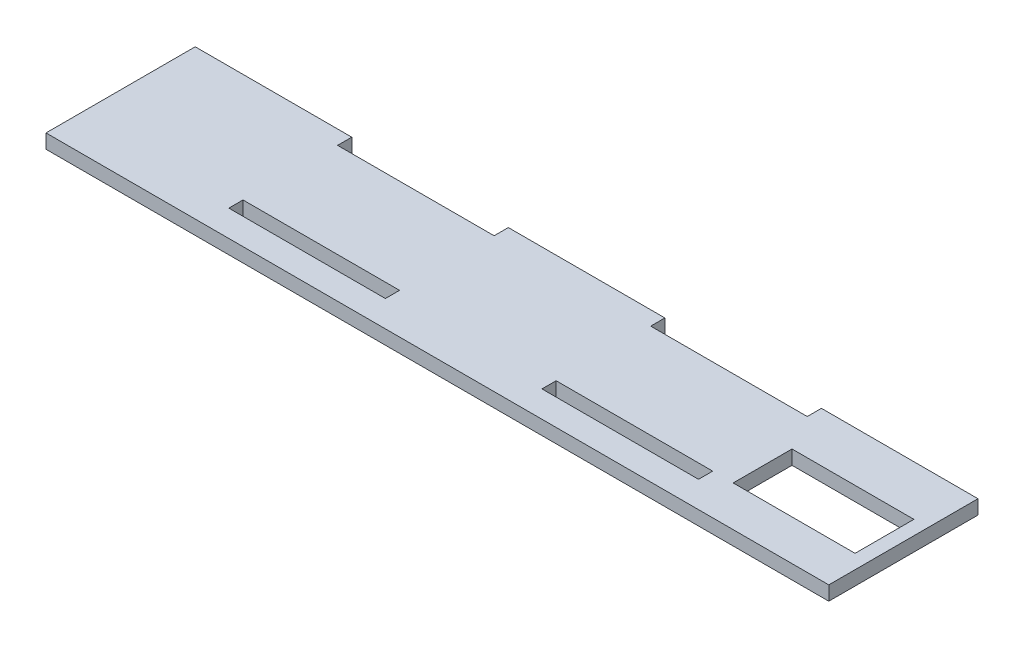
ISO-10303-21;
HEADER;
FILE_DESCRIPTION(('STEP AP214'),'2;1');
FILE_NAME('part.step','',(''),(''),'','','');
FILE_SCHEMA(('AUTOMOTIVE_DESIGN { 1 0 10303 214 1 1 1 1 }'));
ENDSEC;
DATA;
#1=APPLICATION_CONTEXT('core data for automotive mechanical design processes');
#2=APPLICATION_PROTOCOL_DEFINITION('international standard','automotive_design',2000,#1);
#3=PRODUCT_CONTEXT('',#1,'mechanical');
#4=PRODUCT('Part','Part','',(#3));
#5=PRODUCT_RELATED_PRODUCT_CATEGORY('part','',(#4));
#6=PRODUCT_DEFINITION_FORMATION('','',#4);
#7=PRODUCT_DEFINITION_CONTEXT('part definition',#1,'design');
#8=PRODUCT_DEFINITION('design','',#6,#7);
#9=PRODUCT_DEFINITION_SHAPE('','',#8);
#10=(LENGTH_UNIT() NAMED_UNIT(*) SI_UNIT(.MILLI.,.METRE.));
#11=(NAMED_UNIT(*) PLANE_ANGLE_UNIT() SI_UNIT($,.RADIAN.));
#12=(NAMED_UNIT(*) SI_UNIT($,.STERADIAN.) SOLID_ANGLE_UNIT());
#13=UNCERTAINTY_MEASURE_WITH_UNIT(LENGTH_MEASURE(1.E-05),#10,'distance_accuracy_value','');
#14=(GEOMETRIC_REPRESENTATION_CONTEXT(3) GLOBAL_UNCERTAINTY_ASSIGNED_CONTEXT((#13)) GLOBAL_UNIT_ASSIGNED_CONTEXT((#10,
#11,#12)) REPRESENTATION_CONTEXT('',''));
#15=CARTESIAN_POINT('',(0.,0.,0.));
#16=DIRECTION('',(0.,0.,1.));
#17=DIRECTION('',(1.,0.,0.));
#18=AXIS2_PLACEMENT_3D('',#15,#16,#17);
#19=CARTESIAN_POINT('',(0.,2.7,0.));
#20=DIRECTION('',(0.,1.,0.));
#21=DIRECTION('',(0.,0.,1.));
#22=AXIS2_PLACEMENT_3D('',#19,#20,#21);
#23=PLANE('',#22);
#24=DIRECTION('',(-1.,0.,0.));
#25=VECTOR('',#24,1.);
#26=CARTESIAN_POINT('',(44.6999999999999,2.7,-14.2));
#27=LINE('',#26,#25);
#28=CARTESIAN_POINT('',(74.4999999999999,2.7,-14.2));
#29=VERTEX_POINT('',#28);
#30=CARTESIAN_POINT('',(44.6999999999999,2.7,-14.2));
#31=VERTEX_POINT('',#30);
#32=EDGE_CURVE('E292',#29,#31,#27,.T.);
#33=ORIENTED_EDGE('',*,*,#32,.T.);
#34=DIRECTION('',(0.,0.,1.));
#35=VECTOR('',#34,1.);
#36=CARTESIAN_POINT('',(44.6999999999999,2.7,-14.2));
#37=LINE('',#36,#35);
#38=CARTESIAN_POINT('',(44.6999999999999,2.7,-11.5));
#39=VERTEX_POINT('',#38);
#40=EDGE_CURVE('E295',#31,#39,#37,.T.);
#41=ORIENTED_EDGE('',*,*,#40,.T.);
#42=DIRECTION('',(-1.,0.,0.));
#43=VECTOR('',#42,1.);
#44=CARTESIAN_POINT('',(14.8999999999999,2.7,-11.5));
#45=LINE('',#44,#43);
#46=CARTESIAN_POINT('',(14.8999999999999,2.7,-11.5));
#47=VERTEX_POINT('',#46);
#48=EDGE_CURVE('E298',#39,#47,#45,.T.);
#49=ORIENTED_EDGE('',*,*,#48,.T.);
#50=DIRECTION('',(0.,0.,-1.));
#51=VECTOR('',#50,1.);
#52=CARTESIAN_POINT('',(14.8999999999999,2.7,-14.2));
#53=LINE('',#52,#51);
#54=CARTESIAN_POINT('',(14.8999999999999,2.7,-14.2));
#55=VERTEX_POINT('',#54);
#56=EDGE_CURVE('E300',#47,#55,#53,.T.);
#57=ORIENTED_EDGE('',*,*,#56,.T.);
#58=DIRECTION('',(-1.,0.,0.));
#59=VECTOR('',#58,1.);
#60=CARTESIAN_POINT('',(-14.9000000000001,2.7,-14.2));
#61=LINE('',#60,#59);
#62=CARTESIAN_POINT('',(-14.9000000000001,2.7,-14.2));
#63=VERTEX_POINT('',#62);
#64=EDGE_CURVE('E302',#55,#63,#61,.T.);
#65=ORIENTED_EDGE('',*,*,#64,.T.);
#66=DIRECTION('',(0.,0.,1.));
#67=VECTOR('',#66,1.);
#68=CARTESIAN_POINT('',(-14.9000000000001,2.7,-14.2));
#69=LINE('',#68,#67);
#70=CARTESIAN_POINT('',(-14.9000000000001,2.7,-11.5));
#71=VERTEX_POINT('',#70);
#72=EDGE_CURVE('E304',#63,#71,#69,.T.);
#73=ORIENTED_EDGE('',*,*,#72,.T.);
#74=DIRECTION('',(-1.,0.,0.));
#75=VECTOR('',#74,1.);
#76=CARTESIAN_POINT('',(-44.7000000000001,2.7,-11.5));
#77=LINE('',#76,#75);
#78=CARTESIAN_POINT('',(-44.7000000000001,2.7,-11.5));
#79=VERTEX_POINT('',#78);
#80=EDGE_CURVE('E306',#71,#79,#77,.T.);
#81=ORIENTED_EDGE('',*,*,#80,.T.);
#82=DIRECTION('',(0.,0.,-1.));
#83=VECTOR('',#82,1.);
#84=CARTESIAN_POINT('',(-44.7000000000001,2.7,-14.2));
#85=LINE('',#84,#83);
#86=CARTESIAN_POINT('',(-44.7000000000001,2.7,-14.2));
#87=VERTEX_POINT('',#86);
#88=EDGE_CURVE('E308',#79,#87,#85,.T.);
#89=ORIENTED_EDGE('',*,*,#88,.T.);
#90=DIRECTION('',(-1.,0.,0.));
#91=VECTOR('',#90,1.);
#92=CARTESIAN_POINT('',(-74.5000000000001,2.7,-14.2));
#93=LINE('',#92,#91);
#94=CARTESIAN_POINT('',(-74.5000000000001,2.7,-14.2));
#95=VERTEX_POINT('',#94);
#96=EDGE_CURVE('E310',#87,#95,#93,.T.);
#97=ORIENTED_EDGE('',*,*,#96,.T.);
#98=DIRECTION('',(0.,0.,1.));
#99=VECTOR('',#98,1.);
#100=CARTESIAN_POINT('',(-74.5000000000001,2.7,14.2));
#101=LINE('',#100,#99);
#102=CARTESIAN_POINT('',(-74.5000000000001,2.7,14.2));
#103=VERTEX_POINT('',#102);
#104=EDGE_CURVE('E312',#95,#103,#101,.T.);
#105=ORIENTED_EDGE('',*,*,#104,.T.);
#106=DIRECTION('',(1.,0.,0.));
#107=VECTOR('',#106,1.);
#108=CARTESIAN_POINT('',(-74.5000000000001,2.7,14.2));
#109=LINE('',#108,#107);
#110=CARTESIAN_POINT('',(74.4999999999999,2.7,14.2));
#111=VERTEX_POINT('',#110);
#112=EDGE_CURVE('E314',#103,#111,#109,.T.);
#113=ORIENTED_EDGE('',*,*,#112,.T.);
#114=DIRECTION('',(0.,0.,-1.));
#115=VECTOR('',#114,1.);
#116=CARTESIAN_POINT('',(74.4999999999999,2.7,14.2));
#117=LINE('',#116,#115);
#118=EDGE_CURVE('E316',#111,#29,#117,.T.);
#119=ORIENTED_EDGE('',*,*,#118,.T.);
#120=EDGE_LOOP('',(#33,#41,#49,#57,#65,#73,#81,#89,#97,#105,#113,#119));
#121=FACE_BOUND('',#120,.T.);
#122=DIRECTION('',(0.,0.,-1.));
#123=VECTOR('',#122,1.);
#124=CARTESIAN_POINT('',(71.7999999999999,2.7,6.50000000000001));
#125=LINE('',#124,#123);
#126=CARTESIAN_POINT('',(71.7999999999999,2.7,6.50000000000001));
#127=VERTEX_POINT('',#126);
#128=CARTESIAN_POINT('',(71.7999999999999,2.7,-4.69999999999999));
#129=VERTEX_POINT('',#128);
#130=EDGE_CURVE('E263',#127,#129,#125,.T.);
#131=ORIENTED_EDGE('',*,*,#130,.F.);
#132=DIRECTION('',(1.,0.,0.));
#133=VECTOR('',#132,1.);
#134=CARTESIAN_POINT('',(48.5999999999999,2.7,6.50000000000001));
#135=LINE('',#134,#133);
#136=CARTESIAN_POINT('',(48.5999999999999,2.7,6.50000000000001));
#137=VERTEX_POINT('',#136);
#138=EDGE_CURVE('E261',#137,#127,#135,.T.);
#139=ORIENTED_EDGE('',*,*,#138,.F.);
#140=DIRECTION('',(0.,0.,1.));
#141=VECTOR('',#140,1.);
#142=CARTESIAN_POINT('',(48.5999999999999,2.7,-4.69999999999999));
#143=LINE('',#142,#141);
#144=CARTESIAN_POINT('',(48.5999999999999,2.7,-4.69999999999999));
#145=VERTEX_POINT('',#144);
#146=EDGE_CURVE('E269',#145,#137,#143,.T.);
#147=ORIENTED_EDGE('',*,*,#146,.F.);
#148=DIRECTION('',(-1.,0.,0.));
#149=VECTOR('',#148,1.);
#150=CARTESIAN_POINT('',(71.7999999999999,2.7,-4.69999999999999));
#151=LINE('',#150,#149);
#152=EDGE_CURVE('E266',#129,#145,#151,.T.);
#153=ORIENTED_EDGE('',*,*,#152,.F.);
#154=EDGE_LOOP('',(#131,#139,#147,#153));
#155=FACE_BOUND('',#154,.T.);
#156=DIRECTION('',(-1.,0.,0.));
#157=VECTOR('',#156,1.);
#158=CARTESIAN_POINT('',(14.8999999999999,2.7,6.50000000000001));
#159=LINE('',#158,#157);
#160=CARTESIAN_POINT('',(44.6999999999999,2.7,6.50000000000001));
#161=VERTEX_POINT('',#160);
#162=CARTESIAN_POINT('',(14.8999999999999,2.7,6.50000000000001));
#163=VERTEX_POINT('',#162);
#164=EDGE_CURVE('E232',#161,#163,#159,.T.);
#165=ORIENTED_EDGE('',*,*,#164,.F.);
#166=DIRECTION('',(0.,0.,-1.));
#167=VECTOR('',#166,1.);
#168=CARTESIAN_POINT('',(44.6999999999999,2.7,6.50000000000001));
#169=LINE('',#168,#167);
#170=CARTESIAN_POINT('',(44.6999999999999,2.7,9.20000000000001));
#171=VERTEX_POINT('',#170);
#172=EDGE_CURVE('E230',#171,#161,#169,.T.);
#173=ORIENTED_EDGE('',*,*,#172,.F.);
#174=DIRECTION('',(1.,0.,0.));
#175=VECTOR('',#174,1.);
#176=CARTESIAN_POINT('',(14.8999999999999,2.7,9.20000000000001));
#177=LINE('',#176,#175);
#178=CARTESIAN_POINT('',(14.8999999999999,2.7,9.20000000000001));
#179=VERTEX_POINT('',#178);
#180=EDGE_CURVE('E238',#179,#171,#177,.T.);
#181=ORIENTED_EDGE('',*,*,#180,.F.);
#182=DIRECTION('',(0.,0.,1.));
#183=VECTOR('',#182,1.);
#184=CARTESIAN_POINT('',(14.8999999999999,2.7,6.50000000000001));
#185=LINE('',#184,#183);
#186=EDGE_CURVE('E235',#163,#179,#185,.T.);
#187=ORIENTED_EDGE('',*,*,#186,.F.);
#188=EDGE_LOOP('',(#165,#173,#181,#187));
#189=FACE_BOUND('',#188,.T.);
#190=DIRECTION('',(1.,0.,0.));
#191=VECTOR('',#190,1.);
#192=CARTESIAN_POINT('',(-44.7000000000001,2.7,9.20000000000001));
#193=LINE('',#192,#191);
#194=CARTESIAN_POINT('',(-44.7000000000001,2.7,9.20000000000001));
#195=VERTEX_POINT('',#194);
#196=CARTESIAN_POINT('',(-14.9000000000001,2.7,9.20000000000001));
#197=VERTEX_POINT('',#196);
#198=EDGE_CURVE('E202',#195,#197,#193,.T.);
#199=ORIENTED_EDGE('',*,*,#198,.F.);
#200=DIRECTION('',(0.,0.,1.));
#201=VECTOR('',#200,1.);
#202=CARTESIAN_POINT('',(-44.7000000000001,2.7,6.50000000000001));
#203=LINE('',#202,#201);
#204=CARTESIAN_POINT('',(-44.7000000000001,2.7,6.50000000000001));
#205=VERTEX_POINT('',#204);
#206=EDGE_CURVE('E194',#205,#195,#203,.T.);
#207=ORIENTED_EDGE('',*,*,#206,.F.);
#208=DIRECTION('',(-1.,0.,0.));
#209=VECTOR('',#208,1.);
#210=CARTESIAN_POINT('',(-44.7000000000001,2.7,6.50000000000001));
#211=LINE('',#210,#209);
#212=CARTESIAN_POINT('',(-14.9000000000001,2.7,6.50000000000001));
#213=VERTEX_POINT('',#212);
#214=EDGE_CURVE('E216',#213,#205,#211,.T.);
#215=ORIENTED_EDGE('',*,*,#214,.F.);
#216=DIRECTION('',(0.,0.,-1.));
#217=VECTOR('',#216,1.);
#218=CARTESIAN_POINT('',(-14.9000000000001,2.7,6.50000000000001));
#219=LINE('',#218,#217);
#220=EDGE_CURVE('E214',#197,#213,#219,.T.);
#221=ORIENTED_EDGE('',*,*,#220,.F.);
#222=EDGE_LOOP('',(#199,#207,#215,#221));
#223=FACE_BOUND('',#222,.T.);
#224=ADVANCED_FACE('F33',(#121,#155,#189,#223),#23,.T.);
#225=CARTESIAN_POINT('',(0.,0.,0.));
#226=DIRECTION('',(0.,1.,0.));
#227=DIRECTION('',(0.,0.,1.));
#228=AXIS2_PLACEMENT_3D('',#225,#226,#227);
#229=PLANE('',#228);
#230=DIRECTION('',(0.,0.,-1.));
#231=VECTOR('',#230,1.);
#232=CARTESIAN_POINT('',(44.6999999999999,0.,6.50000000000001));
#233=LINE('',#232,#231);
#234=CARTESIAN_POINT('',(44.6999999999999,0.,9.20000000000001));
#235=VERTEX_POINT('',#234);
#236=CARTESIAN_POINT('',(44.6999999999999,0.,6.50000000000001));
#237=VERTEX_POINT('',#236);
#238=EDGE_CURVE('E210',#235,#237,#233,.T.);
#239=ORIENTED_EDGE('',*,*,#238,.T.);
#240=DIRECTION('',(-1.,0.,0.));
#241=VECTOR('',#240,1.);
#242=CARTESIAN_POINT('',(14.8999999999999,0.,6.50000000000001));
#243=LINE('',#242,#241);
#244=CARTESIAN_POINT('',(14.8999999999999,0.,6.50000000000001));
#245=VERTEX_POINT('',#244);
#246=EDGE_CURVE('E243',#237,#245,#243,.T.);
#247=ORIENTED_EDGE('',*,*,#246,.T.);
#248=DIRECTION('',(0.,0.,1.));
#249=VECTOR('',#248,1.);
#250=CARTESIAN_POINT('',(14.8999999999999,0.,6.50000000000001));
#251=LINE('',#250,#249);
#252=CARTESIAN_POINT('',(14.8999999999999,0.,9.20000000000001));
#253=VERTEX_POINT('',#252);
#254=EDGE_CURVE('E246',#245,#253,#251,.T.);
#255=ORIENTED_EDGE('',*,*,#254,.T.);
#256=DIRECTION('',(1.,0.,0.));
#257=VECTOR('',#256,1.);
#258=CARTESIAN_POINT('',(14.8999999999999,0.,9.20000000000001));
#259=LINE('',#258,#257);
#260=EDGE_CURVE('E233',#253,#235,#259,.T.);
#261=ORIENTED_EDGE('',*,*,#260,.T.);
#262=EDGE_LOOP('',(#239,#247,#255,#261));
#263=FACE_BOUND('',#262,.T.);
#264=DIRECTION('',(-1.,0.,0.));
#265=VECTOR('',#264,1.);
#266=CARTESIAN_POINT('',(44.6999999999999,0.,-14.2));
#267=LINE('',#266,#265);
#268=CARTESIAN_POINT('',(74.4999999999999,0.,-14.2));
#269=VERTEX_POINT('',#268);
#270=CARTESIAN_POINT('',(44.6999999999999,0.,-14.2));
#271=VERTEX_POINT('',#270);
#272=EDGE_CURVE('E291',#269,#271,#267,.T.);
#273=ORIENTED_EDGE('',*,*,#272,.F.);
#274=DIRECTION('',(0.,0.,-1.));
#275=VECTOR('',#274,1.);
#276=CARTESIAN_POINT('',(74.4999999999999,0.,14.2));
#277=LINE('',#276,#275);
#278=CARTESIAN_POINT('',(74.4999999999999,0.,14.2));
#279=VERTEX_POINT('',#278);
#280=EDGE_CURVE('E296',#279,#269,#277,.T.);
#281=ORIENTED_EDGE('',*,*,#280,.F.);
#282=DIRECTION('',(1.,0.,0.));
#283=VECTOR('',#282,1.);
#284=CARTESIAN_POINT('',(-74.5000000000001,0.,14.2));
#285=LINE('',#284,#283);
#286=CARTESIAN_POINT('',(-74.5000000000001,0.,14.2));
#287=VERTEX_POINT('',#286);
#288=EDGE_CURVE('E339',#287,#279,#285,.T.);
#289=ORIENTED_EDGE('',*,*,#288,.F.);
#290=DIRECTION('',(0.,0.,1.));
#291=VECTOR('',#290,1.);
#292=CARTESIAN_POINT('',(-74.5000000000001,0.,14.2));
#293=LINE('',#292,#291);
#294=CARTESIAN_POINT('',(-74.5000000000001,0.,-14.2));
#295=VERTEX_POINT('',#294);
#296=EDGE_CURVE('E337',#295,#287,#293,.T.);
#297=ORIENTED_EDGE('',*,*,#296,.F.);
#298=DIRECTION('',(-1.,0.,0.));
#299=VECTOR('',#298,1.);
#300=CARTESIAN_POINT('',(-74.5000000000001,0.,-14.2));
#301=LINE('',#300,#299);
#302=CARTESIAN_POINT('',(-44.7000000000001,0.,-14.2));
#303=VERTEX_POINT('',#302);
#304=EDGE_CURVE('E335',#303,#295,#301,.T.);
#305=ORIENTED_EDGE('',*,*,#304,.F.);
#306=DIRECTION('',(0.,0.,-1.));
#307=VECTOR('',#306,1.);
#308=CARTESIAN_POINT('',(-44.7000000000001,0.,-14.2));
#309=LINE('',#308,#307);
#310=CARTESIAN_POINT('',(-44.7000000000001,0.,-11.5));
#311=VERTEX_POINT('',#310);
#312=EDGE_CURVE('E333',#311,#303,#309,.T.);
#313=ORIENTED_EDGE('',*,*,#312,.F.);
#314=DIRECTION('',(-1.,0.,0.));
#315=VECTOR('',#314,1.);
#316=CARTESIAN_POINT('',(-44.7000000000001,0.,-11.5));
#317=LINE('',#316,#315);
#318=CARTESIAN_POINT('',(-14.9000000000001,0.,-11.5));
#319=VERTEX_POINT('',#318);
#320=EDGE_CURVE('E331',#319,#311,#317,.T.);
#321=ORIENTED_EDGE('',*,*,#320,.F.);
#322=DIRECTION('',(0.,0.,1.));
#323=VECTOR('',#322,1.);
#324=CARTESIAN_POINT('',(-14.9000000000001,0.,-14.2));
#325=LINE('',#324,#323);
#326=CARTESIAN_POINT('',(-14.9000000000001,0.,-14.2));
#327=VERTEX_POINT('',#326);
#328=EDGE_CURVE('E329',#327,#319,#325,.T.);
#329=ORIENTED_EDGE('',*,*,#328,.F.);
#330=DIRECTION('',(-1.,0.,0.));
#331=VECTOR('',#330,1.);
#332=CARTESIAN_POINT('',(-14.9000000000001,0.,-14.2));
#333=LINE('',#332,#331);
#334=CARTESIAN_POINT('',(14.8999999999999,0.,-14.2));
#335=VERTEX_POINT('',#334);
#336=EDGE_CURVE('E327',#335,#327,#333,.T.);
#337=ORIENTED_EDGE('',*,*,#336,.F.);
#338=DIRECTION('',(0.,0.,-1.));
#339=VECTOR('',#338,1.);
#340=CARTESIAN_POINT('',(14.8999999999999,0.,-14.2));
#341=LINE('',#340,#339);
#342=CARTESIAN_POINT('',(14.8999999999999,0.,-11.5));
#343=VERTEX_POINT('',#342);
#344=EDGE_CURVE('E325',#343,#335,#341,.T.);
#345=ORIENTED_EDGE('',*,*,#344,.F.);
#346=DIRECTION('',(-1.,0.,0.));
#347=VECTOR('',#346,1.);
#348=CARTESIAN_POINT('',(14.8999999999999,0.,-11.5));
#349=LINE('',#348,#347);
#350=CARTESIAN_POINT('',(44.6999999999999,0.,-11.5));
#351=VERTEX_POINT('',#350);
#352=EDGE_CURVE('E323',#351,#343,#349,.T.);
#353=ORIENTED_EDGE('',*,*,#352,.F.);
#354=DIRECTION('',(0.,0.,1.));
#355=VECTOR('',#354,1.);
#356=CARTESIAN_POINT('',(44.6999999999999,0.,-14.2));
#357=LINE('',#356,#355);
#358=EDGE_CURVE('E321',#271,#351,#357,.T.);
#359=ORIENTED_EDGE('',*,*,#358,.F.);
#360=EDGE_LOOP('',(#273,#281,#289,#297,#305,#313,#321,#329,#337,#345,#353,#359));
#361=FACE_BOUND('',#360,.T.);
#362=DIRECTION('',(1.,0.,0.));
#363=VECTOR('',#362,1.);
#364=CARTESIAN_POINT('',(48.5999999999999,0.,6.50000000000001));
#365=LINE('',#364,#363);
#366=CARTESIAN_POINT('',(48.5999999999999,0.,6.50000000000001));
#367=VERTEX_POINT('',#366);
#368=CARTESIAN_POINT('',(71.7999999999999,0.,6.50000000000001));
#369=VERTEX_POINT('',#368);
#370=EDGE_CURVE('E260',#367,#369,#365,.T.);
#371=ORIENTED_EDGE('',*,*,#370,.T.);
#372=DIRECTION('',(0.,0.,-1.));
#373=VECTOR('',#372,1.);
#374=CARTESIAN_POINT('',(71.7999999999999,0.,6.50000000000001));
#375=LINE('',#374,#373);
#376=CARTESIAN_POINT('',(71.7999999999999,0.,-4.69999999999999));
#377=VERTEX_POINT('',#376);
#378=EDGE_CURVE('E274',#369,#377,#375,.T.);
#379=ORIENTED_EDGE('',*,*,#378,.T.);
#380=DIRECTION('',(-1.,0.,0.));
#381=VECTOR('',#380,1.);
#382=CARTESIAN_POINT('',(71.7999999999999,0.,-4.69999999999999));
#383=LINE('',#382,#381);
#384=CARTESIAN_POINT('',(48.5999999999999,0.,-4.69999999999999));
#385=VERTEX_POINT('',#384);
#386=EDGE_CURVE('E277',#377,#385,#383,.T.);
#387=ORIENTED_EDGE('',*,*,#386,.T.);
#388=DIRECTION('',(0.,0.,1.));
#389=VECTOR('',#388,1.);
#390=CARTESIAN_POINT('',(48.5999999999999,0.,-4.69999999999999));
#391=LINE('',#390,#389);
#392=EDGE_CURVE('E264',#385,#367,#391,.T.);
#393=ORIENTED_EDGE('',*,*,#392,.T.);
#394=EDGE_LOOP('',(#371,#379,#387,#393));
#395=FACE_BOUND('',#394,.T.);
#396=DIRECTION('',(0.,0.,1.));
#397=VECTOR('',#396,1.);
#398=CARTESIAN_POINT('',(-44.7000000000001,0.,6.50000000000001));
#399=LINE('',#398,#397);
#400=CARTESIAN_POINT('',(-44.7000000000001,0.,6.50000000000001));
#401=VERTEX_POINT('',#400);
#402=CARTESIAN_POINT('',(-44.7000000000001,0.,9.20000000000001));
#403=VERTEX_POINT('',#402);
#404=EDGE_CURVE('E56',#401,#403,#399,.T.);
#405=ORIENTED_EDGE('',*,*,#404,.T.);
#406=DIRECTION('',(1.,0.,0.));
#407=VECTOR('',#406,1.);
#408=CARTESIAN_POINT('',(-44.7000000000001,0.,9.20000000000001));
#409=LINE('',#408,#407);
#410=CARTESIAN_POINT('',(-14.9000000000001,0.,9.20000000000001));
#411=VERTEX_POINT('',#410);
#412=EDGE_CURVE('E209',#403,#411,#409,.T.);
#413=ORIENTED_EDGE('',*,*,#412,.T.);
#414=DIRECTION('',(0.,0.,-1.));
#415=VECTOR('',#414,1.);
#416=CARTESIAN_POINT('',(-14.9000000000001,0.,6.50000000000001));
#417=LINE('',#416,#415);
#418=CARTESIAN_POINT('',(-14.9000000000001,0.,6.50000000000001));
#419=VERTEX_POINT('',#418);
#420=EDGE_CURVE('E222',#411,#419,#417,.T.);
#421=ORIENTED_EDGE('',*,*,#420,.T.);
#422=DIRECTION('',(-1.,0.,0.));
#423=VECTOR('',#422,1.);
#424=CARTESIAN_POINT('',(-44.7000000000001,0.,6.50000000000001));
#425=LINE('',#424,#423);
#426=EDGE_CURVE('E203',#419,#401,#425,.T.);
#427=ORIENTED_EDGE('',*,*,#426,.T.);
#428=EDGE_LOOP('',(#405,#413,#421,#427));
#429=FACE_BOUND('',#428,.T.);
#430=ADVANCED_FACE('F381',(#263,#361,#395,#429),#229,.F.);
#431=CARTESIAN_POINT('',(44.6999999999999,2.7,-14.2));
#432=DIRECTION('',(0.,0.,1.));
#433=DIRECTION('',(1.,0.,0.));
#434=AXIS2_PLACEMENT_3D('',#431,#432,#433);
#435=PLANE('',#434);
#436=ORIENTED_EDGE('',*,*,#272,.T.);
#437=DIRECTION('',(0.,-1.,0.));
#438=VECTOR('',#437,1.);
#439=CARTESIAN_POINT('',(44.6999999999999,2.7,-14.2));
#440=LINE('',#439,#438);
#441=EDGE_CURVE('E11',#31,#271,#440,.T.);
#442=ORIENTED_EDGE('',*,*,#441,.F.);
#443=ORIENTED_EDGE('',*,*,#32,.F.);
#444=DIRECTION('',(0.,-1.,0.));
#445=VECTOR('',#444,1.);
#446=CARTESIAN_POINT('',(74.4999999999999,2.7,-14.2));
#447=LINE('',#446,#445);
#448=EDGE_CURVE('E318',#29,#269,#447,.T.);
#449=ORIENTED_EDGE('',*,*,#448,.T.);
#450=EDGE_LOOP('',(#436,#442,#443,#449));
#451=FACE_BOUND('',#450,.T.);
#452=ADVANCED_FACE('F35',(#451),#435,.F.);
#453=CARTESIAN_POINT('',(44.6999999999999,2.7,-14.2));
#454=DIRECTION('',(1.,0.,0.));
#455=DIRECTION('',(0.,0.,-1.));
#456=AXIS2_PLACEMENT_3D('',#453,#454,#455);
#457=PLANE('',#456);
#458=ORIENTED_EDGE('',*,*,#358,.T.);
#459=DIRECTION('',(0.,-1.,0.));
#460=VECTOR('',#459,1.);
#461=CARTESIAN_POINT('',(44.6999999999999,2.7,-11.5));
#462=LINE('',#461,#460);
#463=EDGE_CURVE('E41',#39,#351,#462,.T.);
#464=ORIENTED_EDGE('',*,*,#463,.F.);
#465=ORIENTED_EDGE('',*,*,#40,.F.);
#466=ORIENTED_EDGE('',*,*,#441,.T.);
#467=EDGE_LOOP('',(#458,#464,#465,#466));
#468=FACE_BOUND('',#467,.T.);
#469=ADVANCED_FACE('F399',(#468),#457,.F.);
#470=CARTESIAN_POINT('',(14.8999999999999,2.7,-11.5));
#471=DIRECTION('',(0.,0.,1.));
#472=DIRECTION('',(1.,0.,0.));
#473=AXIS2_PLACEMENT_3D('',#470,#471,#472);
#474=PLANE('',#473);
#475=ORIENTED_EDGE('',*,*,#352,.T.);
#476=DIRECTION('',(0.,-1.,0.));
#477=VECTOR('',#476,1.);
#478=CARTESIAN_POINT('',(14.8999999999999,2.7,-11.5));
#479=LINE('',#478,#477);
#480=EDGE_CURVE('E368',#47,#343,#479,.T.);
#481=ORIENTED_EDGE('',*,*,#480,.F.);
#482=ORIENTED_EDGE('',*,*,#48,.F.);
#483=ORIENTED_EDGE('',*,*,#463,.T.);
#484=EDGE_LOOP('',(#475,#481,#482,#483));
#485=FACE_BOUND('',#484,.T.);
#486=ADVANCED_FACE('F375',(#485),#474,.F.);
#487=CARTESIAN_POINT('',(14.8999999999999,2.7,-14.2));
#488=DIRECTION('',(-1.,0.,0.));
#489=DIRECTION('',(0.,0.,1.));
#490=AXIS2_PLACEMENT_3D('',#487,#488,#489);
#491=PLANE('',#490);
#492=ORIENTED_EDGE('',*,*,#344,.T.);
#493=DIRECTION('',(0.,-1.,0.));
#494=VECTOR('',#493,1.);
#495=CARTESIAN_POINT('',(14.8999999999999,2.7,-14.2));
#496=LINE('',#495,#494);
#497=EDGE_CURVE('E365',#55,#335,#496,.T.);
#498=ORIENTED_EDGE('',*,*,#497,.F.);
#499=ORIENTED_EDGE('',*,*,#56,.F.);
#500=ORIENTED_EDGE('',*,*,#480,.T.);
#501=EDGE_LOOP('',(#492,#498,#499,#500));
#502=FACE_BOUND('',#501,.T.);
#503=ADVANCED_FACE('F387',(#502),#491,.F.);
#504=CARTESIAN_POINT('',(-14.9000000000001,2.7,-14.2));
#505=DIRECTION('',(0.,0.,1.));
#506=DIRECTION('',(1.,0.,0.));
#507=AXIS2_PLACEMENT_3D('',#504,#505,#506);
#508=PLANE('',#507);
#509=ORIENTED_EDGE('',*,*,#336,.T.);
#510=DIRECTION('',(0.,-1.,0.));
#511=VECTOR('',#510,1.);
#512=CARTESIAN_POINT('',(-14.9000000000001,2.7,-14.2));
#513=LINE('',#512,#511);
#514=EDGE_CURVE('E362',#63,#327,#513,.T.);
#515=ORIENTED_EDGE('',*,*,#514,.F.);
#516=ORIENTED_EDGE('',*,*,#64,.F.);
#517=ORIENTED_EDGE('',*,*,#497,.T.);
#518=EDGE_LOOP('',(#509,#515,#516,#517));
#519=FACE_BOUND('',#518,.T.);
#520=ADVANCED_FACE('F391',(#519),#508,.F.);
#521=CARTESIAN_POINT('',(-14.9000000000001,2.7,-14.2));
#522=DIRECTION('',(1.,0.,0.));
#523=DIRECTION('',(0.,0.,-1.));
#524=AXIS2_PLACEMENT_3D('',#521,#522,#523);
#525=PLANE('',#524);
#526=ORIENTED_EDGE('',*,*,#328,.T.);
#527=DIRECTION('',(0.,-1.,0.));
#528=VECTOR('',#527,1.);
#529=CARTESIAN_POINT('',(-14.9000000000001,2.7,-11.5));
#530=LINE('',#529,#528);
#531=EDGE_CURVE('E359',#71,#319,#530,.T.);
#532=ORIENTED_EDGE('',*,*,#531,.F.);
#533=ORIENTED_EDGE('',*,*,#72,.F.);
#534=ORIENTED_EDGE('',*,*,#514,.T.);
#535=EDGE_LOOP('',(#526,#532,#533,#534));
#536=FACE_BOUND('',#535,.T.);
#537=ADVANCED_FACE('F432',(#536),#525,.F.);
#538=CARTESIAN_POINT('',(-44.7000000000001,2.7,-11.5));
#539=DIRECTION('',(0.,0.,1.));
#540=DIRECTION('',(1.,0.,0.));
#541=AXIS2_PLACEMENT_3D('',#538,#539,#540);
#542=PLANE('',#541);
#543=ORIENTED_EDGE('',*,*,#320,.T.);
#544=DIRECTION('',(0.,-1.,0.));
#545=VECTOR('',#544,1.);
#546=CARTESIAN_POINT('',(-44.7000000000001,2.7,-11.5));
#547=LINE('',#546,#545);
#548=EDGE_CURVE('E356',#79,#311,#547,.T.);
#549=ORIENTED_EDGE('',*,*,#548,.F.);
#550=ORIENTED_EDGE('',*,*,#80,.F.);
#551=ORIENTED_EDGE('',*,*,#531,.T.);
#552=EDGE_LOOP('',(#543,#549,#550,#551));
#553=FACE_BOUND('',#552,.T.);
#554=ADVANCED_FACE('F430',(#553),#542,.F.);
#555=CARTESIAN_POINT('',(-44.7000000000001,2.7,-14.2));
#556=DIRECTION('',(-1.,0.,0.));
#557=DIRECTION('',(0.,0.,1.));
#558=AXIS2_PLACEMENT_3D('',#555,#556,#557);
#559=PLANE('',#558);
#560=ORIENTED_EDGE('',*,*,#312,.T.);
#561=DIRECTION('',(0.,-1.,0.));
#562=VECTOR('',#561,1.);
#563=CARTESIAN_POINT('',(-44.7000000000001,2.7,-14.2));
#564=LINE('',#563,#562);
#565=EDGE_CURVE('E353',#87,#303,#564,.T.);
#566=ORIENTED_EDGE('',*,*,#565,.F.);
#567=ORIENTED_EDGE('',*,*,#88,.F.);
#568=ORIENTED_EDGE('',*,*,#548,.T.);
#569=EDGE_LOOP('',(#560,#566,#567,#568));
#570=FACE_BOUND('',#569,.T.);
#571=ADVANCED_FACE('F426',(#570),#559,.F.);
#572=CARTESIAN_POINT('',(-74.5000000000001,2.7,-14.2));
#573=DIRECTION('',(0.,0.,1.));
#574=DIRECTION('',(1.,0.,0.));
#575=AXIS2_PLACEMENT_3D('',#572,#573,#574);
#576=PLANE('',#575);
#577=ORIENTED_EDGE('',*,*,#304,.T.);
#578=DIRECTION('',(0.,-1.,0.));
#579=VECTOR('',#578,1.);
#580=CARTESIAN_POINT('',(-74.5000000000001,2.7,-14.2));
#581=LINE('',#580,#579);
#582=EDGE_CURVE('E350',#95,#295,#581,.T.);
#583=ORIENTED_EDGE('',*,*,#582,.F.);
#584=ORIENTED_EDGE('',*,*,#96,.F.);
#585=ORIENTED_EDGE('',*,*,#565,.T.);
#586=EDGE_LOOP('',(#577,#583,#584,#585));
#587=FACE_BOUND('',#586,.T.);
#588=ADVANCED_FACE('F421',(#587),#576,.F.);
#589=CARTESIAN_POINT('',(-74.5000000000001,2.7,14.2));
#590=DIRECTION('',(1.,0.,0.));
#591=DIRECTION('',(0.,0.,-1.));
#592=AXIS2_PLACEMENT_3D('',#589,#590,#591);
#593=PLANE('',#592);
#594=ORIENTED_EDGE('',*,*,#296,.T.);
#595=DIRECTION('',(0.,-1.,0.));
#596=VECTOR('',#595,1.);
#597=CARTESIAN_POINT('',(-74.5000000000001,2.7,14.2));
#598=LINE('',#597,#596);
#599=EDGE_CURVE('E347',#103,#287,#598,.T.);
#600=ORIENTED_EDGE('',*,*,#599,.F.);
#601=ORIENTED_EDGE('',*,*,#104,.F.);
#602=ORIENTED_EDGE('',*,*,#582,.T.);
#603=EDGE_LOOP('',(#594,#600,#601,#602));
#604=FACE_BOUND('',#603,.T.);
#605=ADVANCED_FACE('F415',(#604),#593,.F.);
#606=CARTESIAN_POINT('',(-74.5000000000001,2.7,14.2));
#607=DIRECTION('',(0.,0.,-1.));
#608=DIRECTION('',(-1.,0.,0.));
#609=AXIS2_PLACEMENT_3D('',#606,#607,#608);
#610=PLANE('',#609);
#611=ORIENTED_EDGE('',*,*,#288,.T.);
#612=DIRECTION('',(0.,-1.,0.));
#613=VECTOR('',#612,1.);
#614=CARTESIAN_POINT('',(74.4999999999999,2.7,14.2));
#615=LINE('',#614,#613);
#616=EDGE_CURVE('E344',#111,#279,#615,.T.);
#617=ORIENTED_EDGE('',*,*,#616,.F.);
#618=ORIENTED_EDGE('',*,*,#112,.F.);
#619=ORIENTED_EDGE('',*,*,#599,.T.);
#620=EDGE_LOOP('',(#611,#617,#618,#619));
#621=FACE_BOUND('',#620,.T.);
#622=ADVANCED_FACE('F411',(#621),#610,.F.);
#623=CARTESIAN_POINT('',(74.4999999999999,2.7,14.2));
#624=DIRECTION('',(-1.,0.,0.));
#625=DIRECTION('',(0.,0.,1.));
#626=AXIS2_PLACEMENT_3D('',#623,#624,#625);
#627=PLANE('',#626);
#628=ORIENTED_EDGE('',*,*,#280,.T.);
#629=ORIENTED_EDGE('',*,*,#448,.F.);
#630=ORIENTED_EDGE('',*,*,#118,.F.);
#631=ORIENTED_EDGE('',*,*,#616,.T.);
#632=EDGE_LOOP('',(#628,#629,#630,#631));
#633=FACE_BOUND('',#632,.T.);
#634=ADVANCED_FACE('F406',(#633),#627,.F.);
#635=CARTESIAN_POINT('',(48.5999999999999,2.7,6.50000000000001));
#636=DIRECTION('',(0.,0.,-1.));
#637=DIRECTION('',(-1.,0.,0.));
#638=AXIS2_PLACEMENT_3D('',#635,#636,#637);
#639=PLANE('',#638);
#640=ORIENTED_EDGE('',*,*,#370,.F.);
#641=DIRECTION('',(0.,-1.,0.));
#642=VECTOR('',#641,1.);
#643=CARTESIAN_POINT('',(48.5999999999999,2.7,6.50000000000001));
#644=LINE('',#643,#642);
#645=EDGE_CURVE('E271',#137,#367,#644,.T.);
#646=ORIENTED_EDGE('',*,*,#645,.F.);
#647=ORIENTED_EDGE('',*,*,#138,.T.);
#648=DIRECTION('',(0.,-1.,0.));
#649=VECTOR('',#648,1.);
#650=CARTESIAN_POINT('',(71.7999999999999,2.7,6.50000000000001));
#651=LINE('',#650,#649);
#652=EDGE_CURVE('E288',#127,#369,#651,.T.);
#653=ORIENTED_EDGE('',*,*,#652,.T.);
#654=EDGE_LOOP('',(#640,#646,#647,#653));
#655=FACE_BOUND('',#654,.T.);
#656=ADVANCED_FACE('F449',(#655),#639,.T.);
#657=CARTESIAN_POINT('',(71.7999999999999,2.7,6.50000000000001));
#658=DIRECTION('',(-1.,0.,0.));
#659=DIRECTION('',(0.,0.,1.));
#660=AXIS2_PLACEMENT_3D('',#657,#658,#659);
#661=PLANE('',#660);
#662=ORIENTED_EDGE('',*,*,#378,.F.);
#663=ORIENTED_EDGE('',*,*,#652,.F.);
#664=ORIENTED_EDGE('',*,*,#130,.T.);
#665=DIRECTION('',(0.,-1.,0.));
#666=VECTOR('',#665,1.);
#667=CARTESIAN_POINT('',(71.7999999999999,2.7,-4.69999999999999));
#668=LINE('',#667,#666);
#669=EDGE_CURVE('E286',#129,#377,#668,.T.);
#670=ORIENTED_EDGE('',*,*,#669,.T.);
#671=EDGE_LOOP('',(#662,#663,#664,#670));
#672=FACE_BOUND('',#671,.T.);
#673=ADVANCED_FACE('F487',(#672),#661,.T.);
#674=CARTESIAN_POINT('',(71.7999999999999,2.7,-4.69999999999999));
#675=DIRECTION('',(0.,0.,1.));
#676=DIRECTION('',(1.,0.,0.));
#677=AXIS2_PLACEMENT_3D('',#674,#675,#676);
#678=PLANE('',#677);
#679=ORIENTED_EDGE('',*,*,#386,.F.);
#680=ORIENTED_EDGE('',*,*,#669,.F.);
#681=ORIENTED_EDGE('',*,*,#152,.T.);
#682=DIRECTION('',(0.,-1.,0.));
#683=VECTOR('',#682,1.);
#684=CARTESIAN_POINT('',(48.5999999999999,2.7,-4.69999999999999));
#685=LINE('',#684,#683);
#686=EDGE_CURVE('E284',#145,#385,#685,.T.);
#687=ORIENTED_EDGE('',*,*,#686,.T.);
#688=EDGE_LOOP('',(#679,#680,#681,#687));
#689=FACE_BOUND('',#688,.T.);
#690=ADVANCED_FACE('F494',(#689),#678,.T.);
#691=CARTESIAN_POINT('',(48.5999999999999,2.7,-4.69999999999999));
#692=DIRECTION('',(1.,0.,0.));
#693=DIRECTION('',(0.,0.,-1.));
#694=AXIS2_PLACEMENT_3D('',#691,#692,#693);
#695=PLANE('',#694);
#696=ORIENTED_EDGE('',*,*,#392,.F.);
#697=ORIENTED_EDGE('',*,*,#686,.F.);
#698=ORIENTED_EDGE('',*,*,#146,.T.);
#699=ORIENTED_EDGE('',*,*,#645,.T.);
#700=EDGE_LOOP('',(#696,#697,#698,#699));
#701=FACE_BOUND('',#700,.T.);
#702=ADVANCED_FACE('F501',(#701),#695,.T.);
#703=CARTESIAN_POINT('',(44.6999999999999,2.7,6.50000000000001));
#704=DIRECTION('',(-1.,0.,0.));
#705=DIRECTION('',(0.,0.,1.));
#706=AXIS2_PLACEMENT_3D('',#703,#704,#705);
#707=PLANE('',#706);
#708=ORIENTED_EDGE('',*,*,#238,.F.);
#709=DIRECTION('',(0.,-1.,0.));
#710=VECTOR('',#709,1.);
#711=CARTESIAN_POINT('',(44.6999999999999,2.7,9.20000000000001));
#712=LINE('',#711,#710);
#713=EDGE_CURVE('E240',#171,#235,#712,.T.);
#714=ORIENTED_EDGE('',*,*,#713,.F.);
#715=ORIENTED_EDGE('',*,*,#172,.T.);
#716=DIRECTION('',(0.,-1.,0.));
#717=VECTOR('',#716,1.);
#718=CARTESIAN_POINT('',(44.6999999999999,2.7,6.50000000000001));
#719=LINE('',#718,#717);
#720=EDGE_CURVE('E257',#161,#237,#719,.T.);
#721=ORIENTED_EDGE('',*,*,#720,.T.);
#722=EDGE_LOOP('',(#708,#714,#715,#721));
#723=FACE_BOUND('',#722,.T.);
#724=ADVANCED_FACE('F509',(#723),#707,.T.);
#725=CARTESIAN_POINT('',(14.8999999999999,2.7,6.50000000000001));
#726=DIRECTION('',(0.,0.,1.));
#727=DIRECTION('',(1.,0.,0.));
#728=AXIS2_PLACEMENT_3D('',#725,#726,#727);
#729=PLANE('',#728);
#730=ORIENTED_EDGE('',*,*,#246,.F.);
#731=ORIENTED_EDGE('',*,*,#720,.F.);
#732=ORIENTED_EDGE('',*,*,#164,.T.);
#733=DIRECTION('',(0.,-1.,0.));
#734=VECTOR('',#733,1.);
#735=CARTESIAN_POINT('',(14.8999999999999,2.7,6.50000000000001));
#736=LINE('',#735,#734);
#737=EDGE_CURVE('E255',#163,#245,#736,.T.);
#738=ORIENTED_EDGE('',*,*,#737,.T.);
#739=EDGE_LOOP('',(#730,#731,#732,#738));
#740=FACE_BOUND('',#739,.T.);
#741=ADVANCED_FACE('F517',(#740),#729,.T.);
#742=CARTESIAN_POINT('',(14.8999999999999,2.7,6.50000000000001));
#743=DIRECTION('',(1.,0.,0.));
#744=DIRECTION('',(0.,0.,-1.));
#745=AXIS2_PLACEMENT_3D('',#742,#743,#744);
#746=PLANE('',#745);
#747=ORIENTED_EDGE('',*,*,#254,.F.);
#748=ORIENTED_EDGE('',*,*,#737,.F.);
#749=ORIENTED_EDGE('',*,*,#186,.T.);
#750=DIRECTION('',(0.,-1.,0.));
#751=VECTOR('',#750,1.);
#752=CARTESIAN_POINT('',(14.8999999999999,2.7,9.20000000000001));
#753=LINE('',#752,#751);
#754=EDGE_CURVE('E253',#179,#253,#753,.T.);
#755=ORIENTED_EDGE('',*,*,#754,.T.);
#756=EDGE_LOOP('',(#747,#748,#749,#755));
#757=FACE_BOUND('',#756,.T.);
#758=ADVANCED_FACE('F525',(#757),#746,.T.);
#759=CARTESIAN_POINT('',(14.8999999999999,2.7,9.20000000000001));
#760=DIRECTION('',(0.,0.,-1.));
#761=DIRECTION('',(-1.,0.,0.));
#762=AXIS2_PLACEMENT_3D('',#759,#760,#761);
#763=PLANE('',#762);
#764=ORIENTED_EDGE('',*,*,#260,.F.);
#765=ORIENTED_EDGE('',*,*,#754,.F.);
#766=ORIENTED_EDGE('',*,*,#180,.T.);
#767=ORIENTED_EDGE('',*,*,#713,.T.);
#768=EDGE_LOOP('',(#764,#765,#766,#767));
#769=FACE_BOUND('',#768,.T.);
#770=ADVANCED_FACE('F533',(#769),#763,.T.);
#771=CARTESIAN_POINT('',(-44.7000000000001,2.7,6.50000000000001));
#772=DIRECTION('',(1.,0.,0.));
#773=DIRECTION('',(0.,0.,-1.));
#774=AXIS2_PLACEMENT_3D('',#771,#772,#773);
#775=PLANE('',#774);
#776=ORIENTED_EDGE('',*,*,#404,.F.);
#777=DIRECTION('',(0.,-1.,0.));
#778=VECTOR('',#777,1.);
#779=CARTESIAN_POINT('',(-44.7000000000001,2.7,6.50000000000001));
#780=LINE('',#779,#778);
#781=EDGE_CURVE('E198',#205,#401,#780,.T.);
#782=ORIENTED_EDGE('',*,*,#781,.F.);
#783=ORIENTED_EDGE('',*,*,#206,.T.);
#784=DIRECTION('',(0.,-1.,0.));
#785=VECTOR('',#784,1.);
#786=CARTESIAN_POINT('',(-44.7000000000001,2.7,9.20000000000001));
#787=LINE('',#786,#785);
#788=EDGE_CURVE('E197',#195,#403,#787,.T.);
#789=ORIENTED_EDGE('',*,*,#788,.T.);
#790=EDGE_LOOP('',(#776,#782,#783,#789));
#791=FACE_BOUND('',#790,.T.);
#792=ADVANCED_FACE('F196',(#791),#775,.T.);
#793=CARTESIAN_POINT('',(-44.7000000000001,2.7,9.20000000000001));
#794=DIRECTION('',(0.,0.,-1.));
#795=DIRECTION('',(-1.,0.,0.));
#796=AXIS2_PLACEMENT_3D('',#793,#794,#795);
#797=PLANE('',#796);
#798=ORIENTED_EDGE('',*,*,#412,.F.);
#799=ORIENTED_EDGE('',*,*,#788,.F.);
#800=ORIENTED_EDGE('',*,*,#198,.T.);
#801=DIRECTION('',(0.,-1.,0.));
#802=VECTOR('',#801,1.);
#803=CARTESIAN_POINT('',(-14.9000000000001,2.7,9.20000000000001));
#804=LINE('',#803,#802);
#805=EDGE_CURVE('E211',#197,#411,#804,.T.);
#806=ORIENTED_EDGE('',*,*,#805,.T.);
#807=EDGE_LOOP('',(#798,#799,#800,#806));
#808=FACE_BOUND('',#807,.T.);
#809=ADVANCED_FACE('F206',(#808),#797,.T.);
#810=CARTESIAN_POINT('',(-14.9000000000001,2.7,6.50000000000001));
#811=DIRECTION('',(-1.,0.,0.));
#812=DIRECTION('',(0.,0.,1.));
#813=AXIS2_PLACEMENT_3D('',#810,#811,#812);
#814=PLANE('',#813);
#815=ORIENTED_EDGE('',*,*,#420,.F.);
#816=ORIENTED_EDGE('',*,*,#805,.F.);
#817=ORIENTED_EDGE('',*,*,#220,.T.);
#818=DIRECTION('',(0.,-1.,0.));
#819=VECTOR('',#818,1.);
#820=CARTESIAN_POINT('',(-14.9000000000001,2.7,6.50000000000001));
#821=LINE('',#820,#819);
#822=EDGE_CURVE('E48',#213,#419,#821,.T.);
#823=ORIENTED_EDGE('',*,*,#822,.T.);
#824=EDGE_LOOP('',(#815,#816,#817,#823));
#825=FACE_BOUND('',#824,.T.);
#826=ADVANCED_FACE('F554',(#825),#814,.T.);
#827=CARTESIAN_POINT('',(-44.7000000000001,2.7,6.50000000000001));
#828=DIRECTION('',(0.,0.,1.));
#829=DIRECTION('',(1.,0.,0.));
#830=AXIS2_PLACEMENT_3D('',#827,#828,#829);
#831=PLANE('',#830);
#832=ORIENTED_EDGE('',*,*,#426,.F.);
#833=ORIENTED_EDGE('',*,*,#822,.F.);
#834=ORIENTED_EDGE('',*,*,#214,.T.);
#835=ORIENTED_EDGE('',*,*,#781,.T.);
#836=EDGE_LOOP('',(#832,#833,#834,#835));
#837=FACE_BOUND('',#836,.T.);
#838=ADVANCED_FACE('F561',(#837),#831,.T.);
#839=CLOSED_SHELL('',(#224,#430,#452,#469,#486,#503,#520,#537,#554,#571,#588,#605,#622,#634,
#656,#673,#690,#702,#724,#741,#758,#770,#792,#809,#826,#838));
#840=MANIFOLD_SOLID_BREP('B2',#839);
#841=ADVANCED_BREP_SHAPE_REPRESENTATION('',(#18,#840),#14);
#842=SHAPE_DEFINITION_REPRESENTATION(#9,#841);
ENDSEC;
END-ISO-10303-21;
